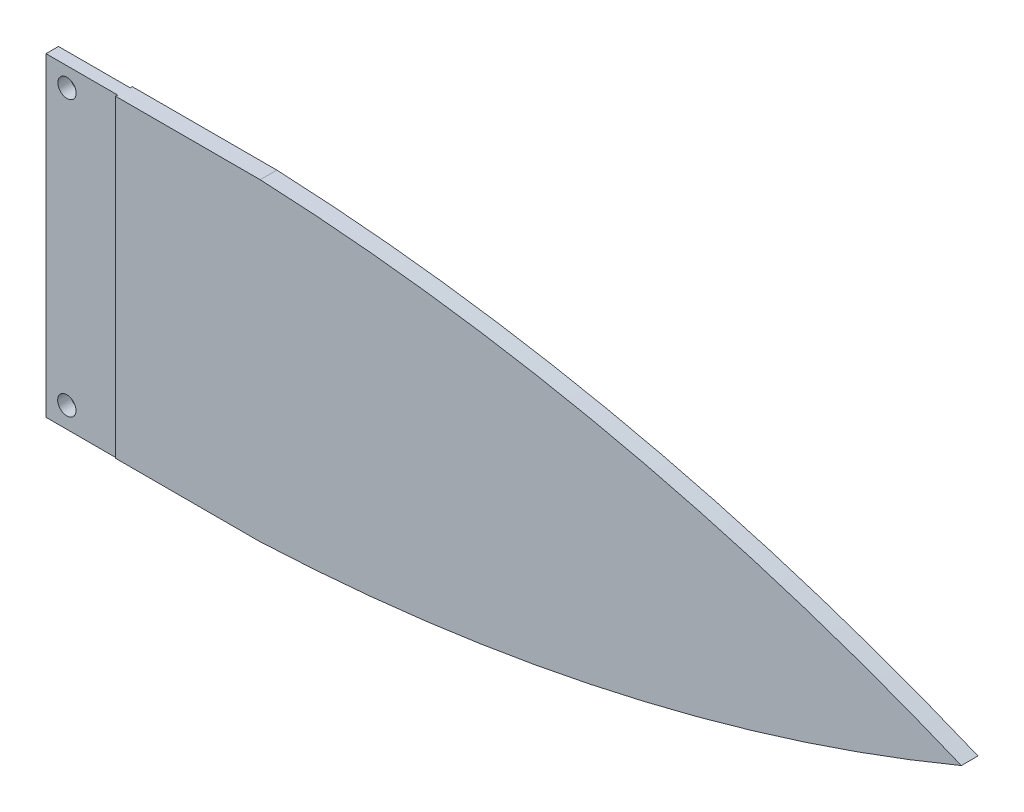
ISO-10303-21;
HEADER;
FILE_DESCRIPTION(('STEP AP214'),'2;1');
FILE_NAME('part.step','',(''),(''),'','','');
FILE_SCHEMA(('AUTOMOTIVE_DESIGN { 1 0 10303 214 1 1 1 1 }'));
ENDSEC;
DATA;
#1=APPLICATION_CONTEXT('core data for automotive mechanical design processes');
#2=APPLICATION_PROTOCOL_DEFINITION('international standard','automotive_design',2000,#1);
#3=PRODUCT_CONTEXT('',#1,'mechanical');
#4=PRODUCT('Part','Part','',(#3));
#5=PRODUCT_RELATED_PRODUCT_CATEGORY('part','',(#4));
#6=PRODUCT_DEFINITION_FORMATION('','',#4);
#7=PRODUCT_DEFINITION_CONTEXT('part definition',#1,'design');
#8=PRODUCT_DEFINITION('design','',#6,#7);
#9=PRODUCT_DEFINITION_SHAPE('','',#8);
#10=(LENGTH_UNIT() NAMED_UNIT(*) SI_UNIT(.MILLI.,.METRE.));
#11=(NAMED_UNIT(*) PLANE_ANGLE_UNIT() SI_UNIT($,.RADIAN.));
#12=(NAMED_UNIT(*) SI_UNIT($,.STERADIAN.) SOLID_ANGLE_UNIT());
#13=UNCERTAINTY_MEASURE_WITH_UNIT(LENGTH_MEASURE(1.E-05),#10,'distance_accuracy_value','');
#14=(GEOMETRIC_REPRESENTATION_CONTEXT(3) GLOBAL_UNCERTAINTY_ASSIGNED_CONTEXT((#13)) GLOBAL_UNIT_ASSIGNED_CONTEXT((#10,
#11,#12)) REPRESENTATION_CONTEXT('',''));
#15=CARTESIAN_POINT('',(0.,0.,0.));
#16=DIRECTION('',(0.,0.,1.));
#17=DIRECTION('',(1.,0.,0.));
#18=AXIS2_PLACEMENT_3D('',#15,#16,#17);
#19=CARTESIAN_POINT('',(0.,0.,-0.75));
#20=DIRECTION('',(0.,0.,1.));
#21=DIRECTION('',(1.,0.,0.));
#22=AXIS2_PLACEMENT_3D('',#19,#20,#21);
#23=PLANE('',#22);
#24=CARTESIAN_POINT('',(-6.60183299389003,-15.7647657841141,-0.75));
#25=DIRECTION('',(0.,0.,1.));
#26=DIRECTION('',(1.,0.,0.));
#27=AXIS2_PLACEMENT_3D('',#24,#25,#26);
#28=CIRCLE('',#27,1.1);
#29=CARTESIAN_POINT('',(-5.50183299389003,-15.7647657841141,-0.75));
#30=VERTEX_POINT('',#29);
#31=EDGE_CURVE('E225',#30,#30,#28,.T.);
#32=ORIENTED_EDGE('',*,*,#31,.T.);
#33=EDGE_LOOP('',(#32));
#34=FACE_BOUND('',#33,.T.);
#35=CARTESIAN_POINT('',(-6.57841140529532,17.2352342158859,-0.75));
#36=DIRECTION('',(0.,0.,1.));
#37=DIRECTION('',(1.,0.,0.));
#38=AXIS2_PLACEMENT_3D('',#35,#36,#37);
#39=CIRCLE('',#38,1.1);
#40=CARTESIAN_POINT('',(-5.47841140529532,17.2352342158859,-0.75));
#41=VERTEX_POINT('',#40);
#42=EDGE_CURVE('E221',#41,#41,#39,.T.);
#43=ORIENTED_EDGE('',*,*,#42,.T.);
#44=EDGE_LOOP('',(#43));
#45=FACE_BOUND('',#44,.T.);
#46=DIRECTION('',(0.,1.,0.));
#47=VECTOR('',#46,1.);
#48=CARTESIAN_POINT('',(-0.716018878796458,0.,-0.75));
#49=LINE('',#48,#47);
#50=CARTESIAN_POINT('',(-0.716018878796458,-18.2647657841141,-0.75));
#51=VERTEX_POINT('',#50);
#52=CARTESIAN_POINT('',(-0.716018878796458,-18.1016450332281,-0.750000000000001));
#53=VERTEX_POINT('',#52);
#54=EDGE_CURVE('E160',#51,#53,#49,.T.);
#55=ORIENTED_EDGE('',*,*,#54,.F.);
#56=DIRECTION('',(1.,0.,0.));
#57=VECTOR('',#56,1.);
#58=CARTESIAN_POINT('',(-9.10183299389003,-18.2647657841141,-0.75));
#59=LINE('',#58,#57);
#60=CARTESIAN_POINT('',(-9.10183299389003,-18.2647657841141,-0.75));
#61=VERTEX_POINT('',#60);
#62=EDGE_CURVE('E232',#61,#51,#59,.T.);
#63=ORIENTED_EDGE('',*,*,#62,.F.);
#64=DIRECTION('',(0.,-1.,0.));
#65=VECTOR('',#64,1.);
#66=CARTESIAN_POINT('',(-9.10183299389003,19.7352342158859,-0.75));
#67=LINE('',#66,#65);
#68=CARTESIAN_POINT('',(-9.10183299389003,19.5352342158859,-0.75));
#69=VERTEX_POINT('',#68);
#70=EDGE_CURVE('E229',#69,#61,#67,.T.);
#71=ORIENTED_EDGE('',*,*,#70,.F.);
#72=DIRECTION('',(-1.,0.,0.));
#73=VECTOR('',#72,1.);
#74=CARTESIAN_POINT('',(0.,19.535234215886,-0.75));
#75=LINE('',#74,#73);
#76=CARTESIAN_POINT('',(-0.5,19.535234215886,-0.75));
#77=VERTEX_POINT('',#76);
#78=EDGE_CURVE('E174',#77,#69,#75,.T.);
#79=ORIENTED_EDGE('',*,*,#78,.F.);
#80=DIRECTION('',(0.,1.,0.));
#81=VECTOR('',#80,1.);
#82=CARTESIAN_POINT('',(-0.5,0.,-0.75));
#83=LINE('',#82,#81);
#84=CARTESIAN_POINT('',(-0.5,-18.1016450332281,-0.75));
#85=VERTEX_POINT('',#84);
#86=EDGE_CURVE('E203',#85,#77,#83,.T.);
#87=ORIENTED_EDGE('',*,*,#86,.F.);
#88=DIRECTION('',(1.,0.,0.));
#89=VECTOR('',#88,1.);
#90=CARTESIAN_POINT('',(0.,-18.1016450332281,-0.75));
#91=LINE('',#90,#89);
#92=EDGE_CURVE('E143',#53,#85,#91,.T.);
#93=ORIENTED_EDGE('',*,*,#92,.F.);
#94=EDGE_LOOP('',(#55,#63,#71,#79,#87,#93));
#95=FACE_BOUND('',#94,.T.);
#96=ADVANCED_FACE('F38',(#34,#45,#95),#23,.F.);
#97=CARTESIAN_POINT('',(0.,0.,0.75));
#98=DIRECTION('',(0.,0.,1.));
#99=DIRECTION('',(1.,0.,0.));
#100=AXIS2_PLACEMENT_3D('',#97,#98,#99);
#101=PLANE('',#100);
#102=CARTESIAN_POINT('',(-6.60183299389003,-15.7647657841141,0.75));
#103=DIRECTION('',(0.,0.,1.));
#104=DIRECTION('',(1.,0.,0.));
#105=AXIS2_PLACEMENT_3D('',#102,#103,#104);
#106=CIRCLE('',#105,1.1);
#107=CARTESIAN_POINT('',(-5.50183299389003,-15.7647657841141,0.75));
#108=VERTEX_POINT('',#107);
#109=EDGE_CURVE('E210',#108,#108,#106,.T.);
#110=ORIENTED_EDGE('',*,*,#109,.F.);
#111=EDGE_LOOP('',(#110));
#112=FACE_BOUND('',#111,.T.);
#113=CARTESIAN_POINT('',(-6.57841140529532,17.2352342158859,0.75));
#114=DIRECTION('',(0.,0.,1.));
#115=DIRECTION('',(1.,0.,0.));
#116=AXIS2_PLACEMENT_3D('',#113,#114,#115);
#117=CIRCLE('',#116,1.1);
#118=CARTESIAN_POINT('',(-5.47841140529532,17.2352342158859,0.75));
#119=VERTEX_POINT('',#118);
#120=EDGE_CURVE('E206',#119,#119,#117,.T.);
#121=ORIENTED_EDGE('',*,*,#120,.F.);
#122=EDGE_LOOP('',(#121));
#123=FACE_BOUND('',#122,.T.);
#124=DIRECTION('',(1.,0.,0.));
#125=VECTOR('',#124,1.);
#126=CARTESIAN_POINT('',(-9.10183299389003,-18.2647657841141,0.75));
#127=LINE('',#126,#125);
#128=CARTESIAN_POINT('',(-9.10183299389003,-18.2647657841141,0.75));
#129=VERTEX_POINT('',#128);
#130=CARTESIAN_POINT('',(-0.716018878796458,-18.2647657841141,0.75));
#131=VERTEX_POINT('',#130);
#132=EDGE_CURVE('E217',#129,#131,#127,.T.);
#133=ORIENTED_EDGE('',*,*,#132,.T.);
#134=DIRECTION('',(0.,1.,0.));
#135=VECTOR('',#134,1.);
#136=CARTESIAN_POINT('',(-0.716018878796458,0.,0.75));
#137=LINE('',#136,#135);
#138=CARTESIAN_POINT('',(-0.716018878796458,-18.1016450332281,0.750000000000001));
#139=VERTEX_POINT('',#138);
#140=EDGE_CURVE('E154',#131,#139,#137,.T.);
#141=ORIENTED_EDGE('',*,*,#140,.T.);
#142=DIRECTION('',(1.,0.,0.));
#143=VECTOR('',#142,1.);
#144=CARTESIAN_POINT('',(0.,-18.1016450332281,0.75));
#145=LINE('',#144,#143);
#146=CARTESIAN_POINT('',(-0.5,-18.1016450332281,0.75));
#147=VERTEX_POINT('',#146);
#148=EDGE_CURVE('E150',#139,#147,#145,.T.);
#149=ORIENTED_EDGE('',*,*,#148,.T.);
#150=DIRECTION('',(0.,1.,0.));
#151=VECTOR('',#150,1.);
#152=CARTESIAN_POINT('',(-0.5,0.,0.75));
#153=LINE('',#152,#151);
#154=CARTESIAN_POINT('',(-0.5,19.535234215886,0.75));
#155=VERTEX_POINT('',#154);
#156=EDGE_CURVE('E240',#147,#155,#153,.T.);
#157=ORIENTED_EDGE('',*,*,#156,.T.);
#158=DIRECTION('',(-1.,0.,0.));
#159=VECTOR('',#158,1.);
#160=CARTESIAN_POINT('',(0.,19.535234215886,0.75));
#161=LINE('',#160,#159);
#162=CARTESIAN_POINT('',(-9.10183299389003,19.5352342158859,0.75));
#163=VERTEX_POINT('',#162);
#164=EDGE_CURVE('E182',#155,#163,#161,.T.);
#165=ORIENTED_EDGE('',*,*,#164,.T.);
#166=DIRECTION('',(0.,-1.,0.));
#167=VECTOR('',#166,1.);
#168=CARTESIAN_POINT('',(-9.10183299389003,19.7352342158859,0.75));
#169=LINE('',#168,#167);
#170=EDGE_CURVE('E214',#163,#129,#169,.T.);
#171=ORIENTED_EDGE('',*,*,#170,.T.);
#172=EDGE_LOOP('',(#133,#141,#149,#157,#165,#171));
#173=FACE_BOUND('',#172,.T.);
#174=ADVANCED_FACE('F269',(#112,#123,#173),#101,.T.);
#175=CARTESIAN_POINT('',(-0.5,0.,0.));
#176=DIRECTION('',(1.,0.,0.));
#177=DIRECTION('',(0.,0.,-1.));
#178=AXIS2_PLACEMENT_3D('',#175,#176,#177);
#179=PLANE('',#178);
#180=DIRECTION('',(0.,0.,-1.));
#181=VECTOR('',#180,1.);
#182=CARTESIAN_POINT('',(-0.5,-18.1016450332281,0.));
#183=LINE('',#182,#181);
#184=CARTESIAN_POINT('',(-0.5,-18.1016450332281,1.));
#185=VERTEX_POINT('',#184);
#186=EDGE_CURVE('E146',#185,#147,#183,.T.);
#187=ORIENTED_EDGE('',*,*,#186,.F.);
#188=DIRECTION('',(0.,1.,0.));
#189=VECTOR('',#188,1.);
#190=CARTESIAN_POINT('',(-0.499999999999987,-19.2647657841141,1.));
#191=LINE('',#190,#189);
#192=CARTESIAN_POINT('',(-0.5,19.535234215886,1.));
#193=VERTEX_POINT('',#192);
#194=EDGE_CURVE('E138',#185,#193,#191,.T.);
#195=ORIENTED_EDGE('',*,*,#194,.T.);
#196=DIRECTION('',(0.,0.,1.));
#197=VECTOR('',#196,1.);
#198=CARTESIAN_POINT('',(-0.5,19.535234215886,0.));
#199=LINE('',#198,#197);
#200=EDGE_CURVE('E175',#155,#193,#199,.T.);
#201=ORIENTED_EDGE('',*,*,#200,.F.);
#202=ORIENTED_EDGE('',*,*,#156,.F.);
#203=EDGE_LOOP('',(#187,#195,#201,#202));
#204=FACE_BOUND('',#203,.T.);
#205=ADVANCED_FACE('F263',(#204),#179,.F.);
#206=CARTESIAN_POINT('',(-0.5,19.535234215886,-1.));
#207=VERTEX_POINT('',#206);
#208=EDGE_CURVE('E136',#207,#77,#199,.T.);
#209=ORIENTED_EDGE('',*,*,#208,.F.);
#210=DIRECTION('',(0.,1.,0.));
#211=VECTOR('',#210,1.);
#212=CARTESIAN_POINT('',(-0.499999999999987,-19.2647657841141,-1.));
#213=LINE('',#212,#211);
#214=CARTESIAN_POINT('',(-0.499999999999987,-18.1016450332281,-1.));
#215=VERTEX_POINT('',#214);
#216=EDGE_CURVE('E124',#215,#207,#213,.T.);
#217=ORIENTED_EDGE('',*,*,#216,.F.);
#218=EDGE_CURVE('E129',#85,#215,#183,.T.);
#219=ORIENTED_EDGE('',*,*,#218,.F.);
#220=ORIENTED_EDGE('',*,*,#86,.T.);
#221=EDGE_LOOP('',(#209,#217,#219,#220));
#222=FACE_BOUND('',#221,.T.);
#223=ADVANCED_FACE('F133',(#222),#179,.F.);
#224=CARTESIAN_POINT('',(5.81122986513974,-227.395722099122,-1.));
#225=DIRECTION('',(0.,0.,-1.));
#226=DIRECTION('',(-1.,0.,0.));
#227=AXIS2_PLACEMENT_3D('',#224,#225,#226);
#228=PLANE('',#227);
#229=CARTESIAN_POINT('',(5.81122986513974,228.832096176784,-1.));
#230=DIRECTION('',(0.,0.,1.));
#231=DIRECTION('',(1.,0.,0.));
#232=AXIS2_PLACEMENT_3D('',#229,#230,#231);
#233=CIRCLE('',#232,247.177785211344);
#234=CARTESIAN_POINT('',(16.7923479326363,-18.1016450332281,-1.));
#235=VERTEX_POINT('',#234);
#236=CARTESIAN_POINT('',(101.,0.718187038831003,-1.));
#237=VERTEX_POINT('',#236);
#238=EDGE_CURVE('E127',#235,#237,#233,.T.);
#239=ORIENTED_EDGE('',*,*,#238,.F.);
#240=DIRECTION('',(-1.,0.,0.));
#241=VECTOR('',#240,1.);
#242=CARTESIAN_POINT('',(5.81122986513974,-18.1016450332281,-1.));
#243=LINE('',#242,#241);
#244=EDGE_CURVE('E60',#235,#215,#243,.T.);
#245=ORIENTED_EDGE('',*,*,#244,.T.);
#246=ORIENTED_EDGE('',*,*,#216,.T.);
#247=DIRECTION('',(1.,0.,0.));
#248=VECTOR('',#247,1.);
#249=CARTESIAN_POINT('',(5.81122986513966,19.535234215886,-1.));
#250=LINE('',#249,#248);
#251=CARTESIAN_POINT('',(16.8547942961207,19.535234215886,-1.));
#252=VERTEX_POINT('',#251);
#253=EDGE_CURVE('E169',#207,#252,#250,.T.);
#254=ORIENTED_EDGE('',*,*,#253,.T.);
#255=CARTESIAN_POINT('',(5.81122986513974,-227.395722099122,-1.));
#256=DIRECTION('',(0.,0.,1.));
#257=DIRECTION('',(-1.,0.,0.));
#258=AXIS2_PLACEMENT_3D('',#255,#256,#257);
#259=CIRCLE('',#258,247.177785211344);
#260=EDGE_CURVE('E193',#237,#252,#259,.T.);
#261=ORIENTED_EDGE('',*,*,#260,.F.);
#262=EDGE_LOOP('',(#239,#245,#246,#254,#261));
#263=FACE_BOUND('',#262,.T.);
#264=ADVANCED_FACE('F122',(#263),#228,.T.);
#265=CARTESIAN_POINT('',(5.81122986513974,-227.395722099122,1.));
#266=DIRECTION('',(0.,0.,-1.));
#267=DIRECTION('',(-1.,0.,0.));
#268=AXIS2_PLACEMENT_3D('',#265,#266,#267);
#269=PLANE('',#268);
#270=DIRECTION('',(-1.,0.,0.));
#271=VECTOR('',#270,1.);
#272=CARTESIAN_POINT('',(5.81122986513974,-18.1016450332281,1.));
#273=LINE('',#272,#271);
#274=CARTESIAN_POINT('',(16.7923479326363,-18.1016450332281,1.));
#275=VERTEX_POINT('',#274);
#276=EDGE_CURVE('E54',#275,#185,#273,.T.);
#277=ORIENTED_EDGE('',*,*,#276,.F.);
#278=CARTESIAN_POINT('',(5.81122986513974,228.832096176784,1.));
#279=DIRECTION('',(0.,0.,1.));
#280=DIRECTION('',(1.,0.,0.));
#281=AXIS2_PLACEMENT_3D('',#278,#279,#280);
#282=CIRCLE('',#281,247.177785211344);
#283=CARTESIAN_POINT('',(101.,0.718187038831003,1.));
#284=VERTEX_POINT('',#283);
#285=EDGE_CURVE('E190',#275,#284,#282,.T.);
#286=ORIENTED_EDGE('',*,*,#285,.T.);
#287=CARTESIAN_POINT('',(5.81122986513974,-227.395722099122,1.));
#288=DIRECTION('',(0.,0.,1.));
#289=DIRECTION('',(-1.,0.,0.));
#290=AXIS2_PLACEMENT_3D('',#287,#288,#289);
#291=CIRCLE('',#290,247.177785211344);
#292=CARTESIAN_POINT('',(16.8547942961207,19.535234215886,1.));
#293=VERTEX_POINT('',#292);
#294=EDGE_CURVE('E186',#284,#293,#291,.T.);
#295=ORIENTED_EDGE('',*,*,#294,.T.);
#296=DIRECTION('',(1.,0.,0.));
#297=VECTOR('',#296,1.);
#298=CARTESIAN_POINT('',(5.81122986513966,19.535234215886,1.));
#299=LINE('',#298,#297);
#300=EDGE_CURVE('E243',#193,#293,#299,.T.);
#301=ORIENTED_EDGE('',*,*,#300,.F.);
#302=ORIENTED_EDGE('',*,*,#194,.F.);
#303=EDGE_LOOP('',(#277,#286,#295,#301,#302));
#304=FACE_BOUND('',#303,.T.);
#305=ADVANCED_FACE('F251',(#304),#269,.F.);
#306=CARTESIAN_POINT('',(-9.10183299389003,-18.2647657841141,-0.75));
#307=DIRECTION('',(0.,-1.,0.));
#308=DIRECTION('',(0.,0.,-1.));
#309=AXIS2_PLACEMENT_3D('',#306,#307,#308);
#310=PLANE('',#309);
#311=ORIENTED_EDGE('',*,*,#62,.T.);
#312=DIRECTION('',(0.,0.,1.));
#313=VECTOR('',#312,1.);
#314=CARTESIAN_POINT('',(-0.716018878796458,-18.2647657841141,-0.75));
#315=LINE('',#314,#313);
#316=EDGE_CURVE('E11',#51,#131,#315,.T.);
#317=ORIENTED_EDGE('',*,*,#316,.T.);
#318=ORIENTED_EDGE('',*,*,#132,.F.);
#319=DIRECTION('',(0.,0.,1.));
#320=VECTOR('',#319,1.);
#321=CARTESIAN_POINT('',(-9.10183299389003,-18.2647657841141,-0.75));
#322=LINE('',#321,#320);
#323=EDGE_CURVE('E236',#61,#129,#322,.T.);
#324=ORIENTED_EDGE('',*,*,#323,.F.);
#325=EDGE_LOOP('',(#311,#317,#318,#324));
#326=FACE_BOUND('',#325,.T.);
#327=ADVANCED_FACE('F276',(#326),#310,.T.);
#328=CARTESIAN_POINT('',(5.81122986513974,228.832096176784,-1.));
#329=DIRECTION('',(0.,0.,1.));
#330=DIRECTION('',(1.,0.,0.));
#331=AXIS2_PLACEMENT_3D('',#328,#329,#330);
#332=CYLINDRICAL_SURFACE('',#331,247.177785211344);
#333=ORIENTED_EDGE('',*,*,#285,.F.);
#334=DIRECTION('',(0.,0.,1.));
#335=VECTOR('',#334,1.);
#336=CARTESIAN_POINT('',(16.7923479326363,-18.1016450332281,-1.00000000000004));
#337=LINE('',#336,#335);
#338=EDGE_CURVE('E47',#275,#235,#337,.F.);
#339=ORIENTED_EDGE('',*,*,#338,.T.);
#340=ORIENTED_EDGE('',*,*,#238,.T.);
#341=DIRECTION('',(0.,0.,1.));
#342=VECTOR('',#341,1.);
#343=CARTESIAN_POINT('',(101.,0.718187038831003,-1.));
#344=LINE('',#343,#342);
#345=EDGE_CURVE('E199',#237,#284,#344,.T.);
#346=ORIENTED_EDGE('',*,*,#345,.T.);
#347=EDGE_LOOP('',(#333,#339,#340,#346));
#348=FACE_BOUND('',#347,.T.);
#349=ADVANCED_FACE('F248',(#348),#332,.T.);
#350=CARTESIAN_POINT('',(-9.10183299389003,19.7352342158859,-0.75));
#351=DIRECTION('',(-1.,0.,0.));
#352=DIRECTION('',(0.,0.,1.));
#353=AXIS2_PLACEMENT_3D('',#350,#351,#352);
#354=PLANE('',#353);
#355=ORIENTED_EDGE('',*,*,#170,.F.);
#356=DIRECTION('',(0.,0.,-1.));
#357=VECTOR('',#356,1.);
#358=CARTESIAN_POINT('',(-9.10183299389003,19.5352342158859,-0.75));
#359=LINE('',#358,#357);
#360=EDGE_CURVE('E178',#163,#69,#359,.T.);
#361=ORIENTED_EDGE('',*,*,#360,.T.);
#362=ORIENTED_EDGE('',*,*,#70,.T.);
#363=ORIENTED_EDGE('',*,*,#323,.T.);
#364=EDGE_LOOP('',(#355,#361,#362,#363));
#365=FACE_BOUND('',#364,.T.);
#366=ADVANCED_FACE('F40',(#365),#354,.T.);
#367=CARTESIAN_POINT('',(5.81122986513974,-227.395722099122,-1.));
#368=DIRECTION('',(0.,0.,1.));
#369=DIRECTION('',(1.,0.,0.));
#370=AXIS2_PLACEMENT_3D('',#367,#368,#369);
#371=CYLINDRICAL_SURFACE('',#370,247.177785211344);
#372=ORIENTED_EDGE('',*,*,#260,.T.);
#373=DIRECTION('',(0.,0.,1.));
#374=VECTOR('',#373,1.);
#375=CARTESIAN_POINT('',(16.8547942961207,19.535234215886,-1.));
#376=LINE('',#375,#374);
#377=EDGE_CURVE('E165',#252,#293,#376,.T.);
#378=ORIENTED_EDGE('',*,*,#377,.T.);
#379=ORIENTED_EDGE('',*,*,#294,.F.);
#380=ORIENTED_EDGE('',*,*,#345,.F.);
#381=EDGE_LOOP('',(#372,#378,#379,#380));
#382=FACE_BOUND('',#381,.T.);
#383=ADVANCED_FACE('F284',(#382),#371,.T.);
#384=CARTESIAN_POINT('',(-6.60183299389003,-15.7647657841141,-0.75));
#385=DIRECTION('',(0.,0.,1.));
#386=DIRECTION('',(1.,0.,0.));
#387=AXIS2_PLACEMENT_3D('',#384,#385,#386);
#388=CYLINDRICAL_SURFACE('',#387,1.1);
#389=ORIENTED_EDGE('',*,*,#31,.F.);
#390=EDGE_LOOP('',(#389));
#391=FACE_BOUND('',#390,.T.);
#392=ORIENTED_EDGE('',*,*,#109,.T.);
#393=EDGE_LOOP('',(#392));
#394=FACE_BOUND('',#393,.T.);
#395=ADVANCED_FACE('F287',(#391,#394),#388,.F.);
#396=CARTESIAN_POINT('',(-6.57841140529532,17.2352342158859,-0.75));
#397=DIRECTION('',(0.,0.,1.));
#398=DIRECTION('',(1.,0.,0.));
#399=AXIS2_PLACEMENT_3D('',#396,#397,#398);
#400=CYLINDRICAL_SURFACE('',#399,1.1);
#401=ORIENTED_EDGE('',*,*,#42,.F.);
#402=EDGE_LOOP('',(#401));
#403=FACE_BOUND('',#402,.T.);
#404=ORIENTED_EDGE('',*,*,#120,.T.);
#405=EDGE_LOOP('',(#404));
#406=FACE_BOUND('',#405,.T.);
#407=ADVANCED_FACE('F293',(#403,#406),#400,.F.);
#408=CARTESIAN_POINT('',(0.,19.535234215886,0.));
#409=DIRECTION('',(0.,1.,0.));
#410=DIRECTION('',(-1.,0.,0.));
#411=AXIS2_PLACEMENT_3D('',#408,#409,#410);
#412=PLANE('',#411);
#413=ORIENTED_EDGE('',*,*,#200,.T.);
#414=ORIENTED_EDGE('',*,*,#300,.T.);
#415=ORIENTED_EDGE('',*,*,#377,.F.);
#416=ORIENTED_EDGE('',*,*,#253,.F.);
#417=ORIENTED_EDGE('',*,*,#208,.T.);
#418=ORIENTED_EDGE('',*,*,#78,.T.);
#419=ORIENTED_EDGE('',*,*,#360,.F.);
#420=ORIENTED_EDGE('',*,*,#164,.F.);
#421=EDGE_LOOP('',(#413,#414,#415,#416,#417,#418,#419,#420));
#422=FACE_BOUND('',#421,.T.);
#423=ADVANCED_FACE('F266',(#422),#412,.T.);
#424=CARTESIAN_POINT('',(-0.716018878796458,-18.5016450332281,9.99999999999999));
#425=DIRECTION('',(1.,0.,0.));
#426=DIRECTION('',(0.,0.,-1.));
#427=AXIS2_PLACEMENT_3D('',#424,#425,#426);
#428=PLANE('',#427);
#429=ORIENTED_EDGE('',*,*,#54,.T.);
#430=DIRECTION('',(0.,0.,-1.));
#431=VECTOR('',#430,1.);
#432=CARTESIAN_POINT('',(-0.716018878796458,-18.1016450332281,9.99999999999999));
#433=LINE('',#432,#431);
#434=EDGE_CURVE('E254',#139,#53,#433,.T.);
#435=ORIENTED_EDGE('',*,*,#434,.F.);
#436=ORIENTED_EDGE('',*,*,#140,.F.);
#437=ORIENTED_EDGE('',*,*,#316,.F.);
#438=EDGE_LOOP('',(#429,#435,#436,#437));
#439=FACE_BOUND('',#438,.T.);
#440=ADVANCED_FACE('F279',(#439),#428,.T.);
#441=CARTESIAN_POINT('',(0.,-18.1016450332281,0.));
#442=DIRECTION('',(0.,-1.,0.));
#443=DIRECTION('',(0.,0.,-1.));
#444=AXIS2_PLACEMENT_3D('',#441,#442,#443);
#445=PLANE('',#444);
#446=ORIENTED_EDGE('',*,*,#276,.T.);
#447=ORIENTED_EDGE('',*,*,#186,.T.);
#448=ORIENTED_EDGE('',*,*,#148,.F.);
#449=ORIENTED_EDGE('',*,*,#434,.T.);
#450=ORIENTED_EDGE('',*,*,#92,.T.);
#451=ORIENTED_EDGE('',*,*,#218,.T.);
#452=ORIENTED_EDGE('',*,*,#244,.F.);
#453=ORIENTED_EDGE('',*,*,#338,.F.);
#454=EDGE_LOOP('',(#446,#447,#448,#449,#450,#451,#452,#453));
#455=FACE_BOUND('',#454,.T.);
#456=ADVANCED_FACE('F140',(#455),#445,.T.);
#457=CLOSED_SHELL('',(#96,#174,#205,#223,#264,#305,#327,#349,#366,#383,#395,#407,#423,#440,#456));
#458=MANIFOLD_SOLID_BREP('B2',#457);
#459=ADVANCED_BREP_SHAPE_REPRESENTATION('',(#18,#458),#14);
#460=SHAPE_DEFINITION_REPRESENTATION(#9,#459);
ENDSEC;
END-ISO-10303-21;
